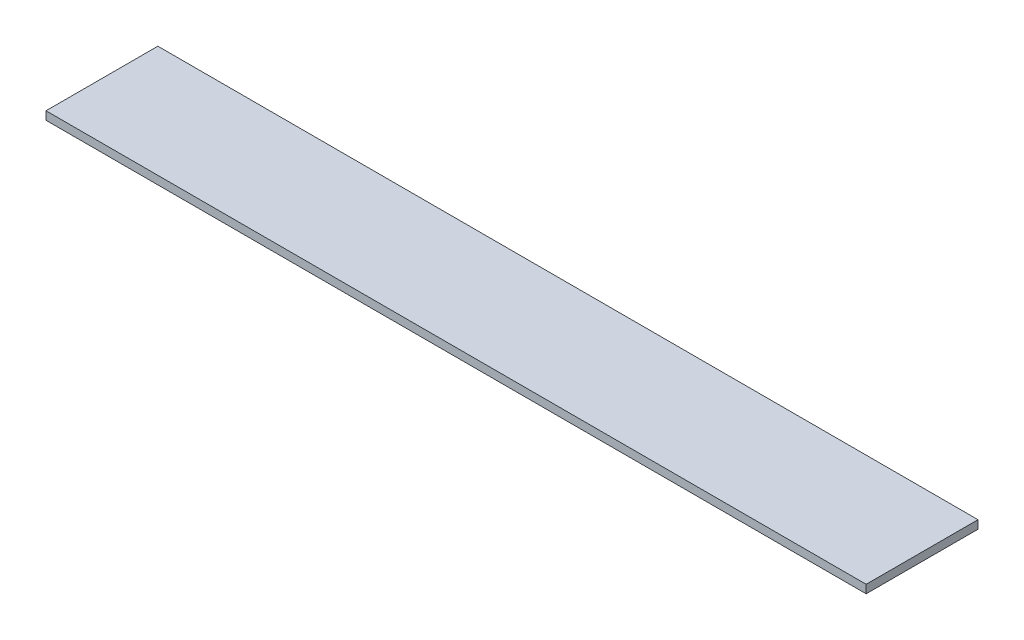
ISO-10303-21;
HEADER;
FILE_DESCRIPTION(('STEP AP214'),'2;1');
FILE_NAME('part.step','',(''),(''),'','','');
FILE_SCHEMA(('AUTOMOTIVE_DESIGN { 1 0 10303 214 1 1 1 1 }'));
ENDSEC;
DATA;
#1=APPLICATION_CONTEXT('core data for automotive mechanical design processes');
#2=APPLICATION_PROTOCOL_DEFINITION('international standard','automotive_design',2000,#1);
#3=PRODUCT_CONTEXT('',#1,'mechanical');
#4=PRODUCT('Part','Part','',(#3));
#5=PRODUCT_RELATED_PRODUCT_CATEGORY('part','',(#4));
#6=PRODUCT_DEFINITION_FORMATION('','',#4);
#7=PRODUCT_DEFINITION_CONTEXT('part definition',#1,'design');
#8=PRODUCT_DEFINITION('design','',#6,#7);
#9=PRODUCT_DEFINITION_SHAPE('','',#8);
#10=(LENGTH_UNIT() NAMED_UNIT(*) SI_UNIT(.MILLI.,.METRE.));
#11=(NAMED_UNIT(*) PLANE_ANGLE_UNIT() SI_UNIT($,.RADIAN.));
#12=(NAMED_UNIT(*) SI_UNIT($,.STERADIAN.) SOLID_ANGLE_UNIT());
#13=UNCERTAINTY_MEASURE_WITH_UNIT(LENGTH_MEASURE(1.E-05),#10,'distance_accuracy_value','');
#14=(GEOMETRIC_REPRESENTATION_CONTEXT(3) GLOBAL_UNCERTAINTY_ASSIGNED_CONTEXT((#13)) GLOBAL_UNIT_ASSIGNED_CONTEXT((#10,
#11,#12)) REPRESENTATION_CONTEXT('',''));
#15=CARTESIAN_POINT('',(0.,0.,0.));
#16=DIRECTION('',(0.,0.,1.));
#17=DIRECTION('',(1.,0.,0.));
#18=AXIS2_PLACEMENT_3D('',#15,#16,#17);
#19=CARTESIAN_POINT('',(-185.,5.6388,-3.17499999999998));
#20=DIRECTION('',(0.,0.,1.));
#21=DIRECTION('',(1.,0.,0.));
#22=AXIS2_PLACEMENT_3D('',#19,#20,#21);
#23=PLANE('',#22);
#24=DIRECTION('',(-1.,0.,0.));
#25=VECTOR('',#24,1.);
#26=CARTESIAN_POINT('',(-185.,0.,-3.17499999999998));
#27=LINE('',#26,#25);
#28=CARTESIAN_POINT('',(373.7224,0.,-3.17500000000002));
#29=VERTEX_POINT('',#28);
#30=CARTESIAN_POINT('',(-185.,0.,-3.17499999999998));
#31=VERTEX_POINT('',#30);
#32=EDGE_CURVE('E70',#29,#31,#27,.T.);
#33=ORIENTED_EDGE('',*,*,#32,.T.);
#34=DIRECTION('',(0.,-1.,0.));
#35=VECTOR('',#34,1.);
#36=CARTESIAN_POINT('',(-185.,5.6388,-3.17499999999998));
#37=LINE('',#36,#35);
#38=CARTESIAN_POINT('',(-185.,5.6388,-3.17499999999998));
#39=VERTEX_POINT('',#38);
#40=EDGE_CURVE('E11',#39,#31,#37,.T.);
#41=ORIENTED_EDGE('',*,*,#40,.F.);
#42=DIRECTION('',(-1.,0.,0.));
#43=VECTOR('',#42,1.);
#44=CARTESIAN_POINT('',(175.,5.6388,-3.17500000000002));
#45=LINE('',#44,#43);
#46=CARTESIAN_POINT('',(373.7224,5.6388,-3.17500000000002));
#47=VERTEX_POINT('',#46);
#48=EDGE_CURVE('E74',#47,#39,#45,.T.);
#49=ORIENTED_EDGE('',*,*,#48,.F.);
#50=DIRECTION('',(0.,-1.,0.));
#51=VECTOR('',#50,1.);
#52=CARTESIAN_POINT('',(373.7224,5.6388,-3.17500000000002));
#53=LINE('',#52,#51);
#54=EDGE_CURVE('E93',#47,#29,#53,.T.);
#55=ORIENTED_EDGE('',*,*,#54,.T.);
#56=EDGE_LOOP('',(#33,#41,#49,#55));
#57=FACE_BOUND('',#56,.T.);
#58=ADVANCED_FACE('F33',(#57),#23,.F.);
#59=CARTESIAN_POINT('',(-185.,5.6388,6.82500000000009));
#60=DIRECTION('',(1.,0.,0.));
#61=DIRECTION('',(0.,0.,-1.));
#62=AXIS2_PLACEMENT_3D('',#59,#60,#61);
#63=PLANE('',#62);
#64=DIRECTION('',(0.,0.,1.));
#65=VECTOR('',#64,1.);
#66=CARTESIAN_POINT('',(-185.,0.,6.82500000000009));
#67=LINE('',#66,#65);
#68=CARTESIAN_POINT('',(-185.,0.,73.025));
#69=VERTEX_POINT('',#68);
#70=EDGE_CURVE('E87',#31,#69,#67,.T.);
#71=ORIENTED_EDGE('',*,*,#70,.T.);
#72=DIRECTION('',(0.,-1.,0.));
#73=VECTOR('',#72,1.);
#74=CARTESIAN_POINT('',(-185.,5.6388,73.025));
#75=LINE('',#74,#73);
#76=CARTESIAN_POINT('',(-185.,5.6388,73.025));
#77=VERTEX_POINT('',#76);
#78=EDGE_CURVE('E41',#77,#69,#75,.T.);
#79=ORIENTED_EDGE('',*,*,#78,.F.);
#80=DIRECTION('',(0.,0.,1.));
#81=VECTOR('',#80,1.);
#82=CARTESIAN_POINT('',(-185.,5.6388,6.82500000000009));
#83=LINE('',#82,#81);
#84=EDGE_CURVE('E77',#39,#77,#83,.T.);
#85=ORIENTED_EDGE('',*,*,#84,.F.);
#86=ORIENTED_EDGE('',*,*,#40,.T.);
#87=EDGE_LOOP('',(#71,#79,#85,#86));
#88=FACE_BOUND('',#87,.T.);
#89=ADVANCED_FACE('F86',(#88),#63,.F.);
#90=CARTESIAN_POINT('',(-185.,5.6388,73.025));
#91=DIRECTION('',(0.,0.,-1.));
#92=DIRECTION('',(-1.,0.,0.));
#93=AXIS2_PLACEMENT_3D('',#90,#91,#92);
#94=PLANE('',#93);
#95=DIRECTION('',(1.,0.,0.));
#96=VECTOR('',#95,1.);
#97=CARTESIAN_POINT('',(-185.,0.,73.025));
#98=LINE('',#97,#96);
#99=CARTESIAN_POINT('',(373.7224,0.,73.025));
#100=VERTEX_POINT('',#99);
#101=EDGE_CURVE('E99',#69,#100,#98,.T.);
#102=ORIENTED_EDGE('',*,*,#101,.T.);
#103=DIRECTION('',(0.,-1.,0.));
#104=VECTOR('',#103,1.);
#105=CARTESIAN_POINT('',(373.7224,5.6388,73.025));
#106=LINE('',#105,#104);
#107=CARTESIAN_POINT('',(373.7224,5.6388,73.025));
#108=VERTEX_POINT('',#107);
#109=EDGE_CURVE('E89',#108,#100,#106,.T.);
#110=ORIENTED_EDGE('',*,*,#109,.F.);
#111=DIRECTION('',(1.,0.,0.));
#112=VECTOR('',#111,1.);
#113=CARTESIAN_POINT('',(-185.,5.6388,73.025));
#114=LINE('',#113,#112);
#115=EDGE_CURVE('E81',#77,#108,#114,.T.);
#116=ORIENTED_EDGE('',*,*,#115,.F.);
#117=ORIENTED_EDGE('',*,*,#78,.T.);
#118=EDGE_LOOP('',(#102,#110,#116,#117));
#119=FACE_BOUND('',#118,.T.);
#120=ADVANCED_FACE('F90',(#119),#94,.F.);
#121=CARTESIAN_POINT('',(373.7224,5.6388,-3.17500000000002));
#122=DIRECTION('',(-1.,0.,0.));
#123=DIRECTION('',(0.,0.,1.));
#124=AXIS2_PLACEMENT_3D('',#121,#122,#123);
#125=PLANE('',#124);
#126=DIRECTION('',(0.,0.,-1.));
#127=VECTOR('',#126,1.);
#128=CARTESIAN_POINT('',(373.7224,0.,-3.17500000000002));
#129=LINE('',#128,#127);
#130=EDGE_CURVE('E66',#100,#29,#129,.T.);
#131=ORIENTED_EDGE('',*,*,#130,.T.);
#132=ORIENTED_EDGE('',*,*,#54,.F.);
#133=DIRECTION('',(0.,0.,-1.));
#134=VECTOR('',#133,1.);
#135=CARTESIAN_POINT('',(373.7224,5.6388,6.82500000000005));
#136=LINE('',#135,#134);
#137=EDGE_CURVE('E49',#108,#47,#136,.T.);
#138=ORIENTED_EDGE('',*,*,#137,.F.);
#139=ORIENTED_EDGE('',*,*,#109,.T.);
#140=EDGE_LOOP('',(#131,#132,#138,#139));
#141=FACE_BOUND('',#140,.T.);
#142=ADVANCED_FACE('F105',(#141),#125,.F.);
#143=CARTESIAN_POINT('',(0.,5.6388,0.));
#144=DIRECTION('',(0.,-1.,0.));
#145=DIRECTION('',(0.,0.,-1.));
#146=AXIS2_PLACEMENT_3D('',#143,#144,#145);
#147=PLANE('',#146);
#148=ORIENTED_EDGE('',*,*,#48,.T.);
#149=ORIENTED_EDGE('',*,*,#84,.T.);
#150=ORIENTED_EDGE('',*,*,#115,.T.);
#151=ORIENTED_EDGE('',*,*,#137,.T.);
#152=EDGE_LOOP('',(#148,#149,#150,#151));
#153=FACE_BOUND('',#152,.T.);
#154=ADVANCED_FACE('F79',(#153),#147,.F.);
#155=CARTESIAN_POINT('',(0.,0.,0.));
#156=DIRECTION('',(0.,-1.,0.));
#157=DIRECTION('',(0.,0.,-1.));
#158=AXIS2_PLACEMENT_3D('',#155,#156,#157);
#159=PLANE('',#158);
#160=ORIENTED_EDGE('',*,*,#32,.F.);
#161=ORIENTED_EDGE('',*,*,#130,.F.);
#162=ORIENTED_EDGE('',*,*,#101,.F.);
#163=ORIENTED_EDGE('',*,*,#70,.F.);
#164=EDGE_LOOP('',(#160,#161,#162,#163));
#165=FACE_BOUND('',#164,.T.);
#166=ADVANCED_FACE('F118',(#165),#159,.T.);
#167=CLOSED_SHELL('',(#58,#89,#120,#142,#154,#166));
#168=MANIFOLD_SOLID_BREP('B2',#167);
#169=ADVANCED_BREP_SHAPE_REPRESENTATION('',(#18,#168),#14);
#170=SHAPE_DEFINITION_REPRESENTATION(#9,#169);
ENDSEC;
END-ISO-10303-21;
